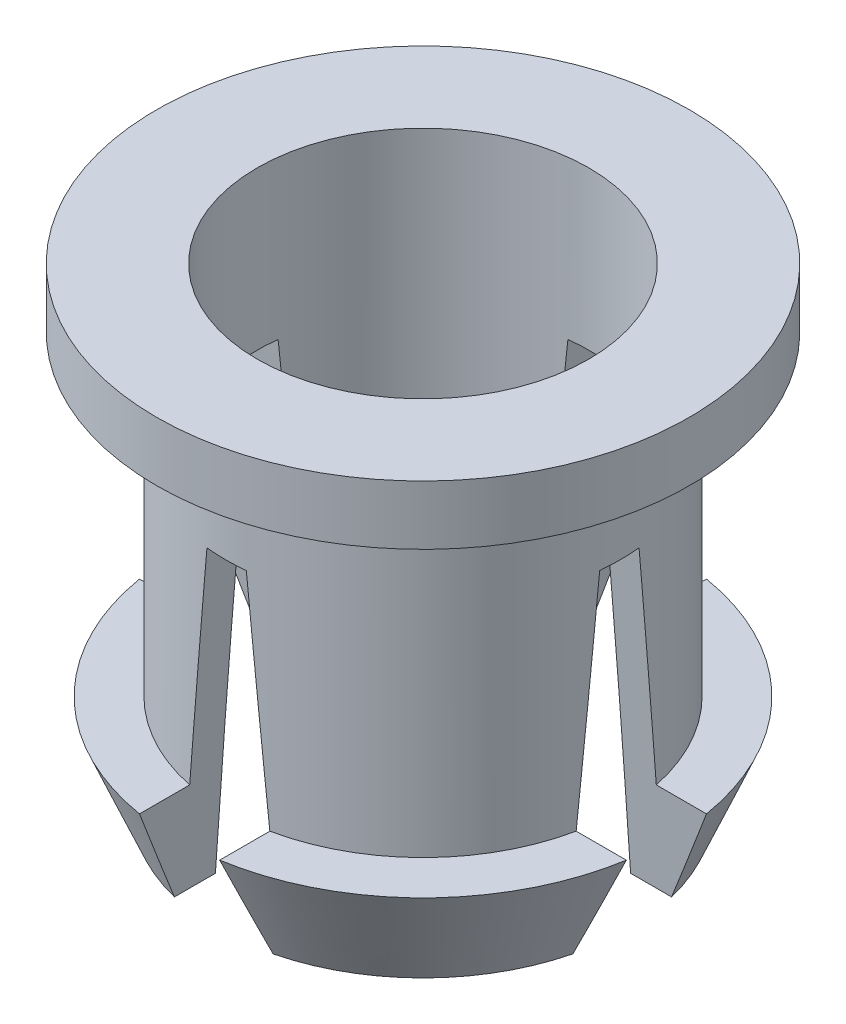
ISO-10303-21;
HEADER;
FILE_DESCRIPTION(('STEP AP214'),'2;1');
FILE_NAME('part.step','',(''),(''),'','','');
FILE_SCHEMA(('AUTOMOTIVE_DESIGN { 1 0 10303 214 1 1 1 1 }'));
ENDSEC;
DATA;
#1=APPLICATION_CONTEXT('core data for automotive mechanical design processes');
#2=APPLICATION_PROTOCOL_DEFINITION('international standard','automotive_design',2000,#1);
#3=PRODUCT_CONTEXT('',#1,'mechanical');
#4=PRODUCT('Part','Part','',(#3));
#5=PRODUCT_RELATED_PRODUCT_CATEGORY('part','',(#4));
#6=PRODUCT_DEFINITION_FORMATION('','',#4);
#7=PRODUCT_DEFINITION_CONTEXT('part definition',#1,'design');
#8=PRODUCT_DEFINITION('design','',#6,#7);
#9=PRODUCT_DEFINITION_SHAPE('','',#8);
#10=(LENGTH_UNIT() NAMED_UNIT(*) SI_UNIT(.MILLI.,.METRE.));
#11=(NAMED_UNIT(*) PLANE_ANGLE_UNIT() SI_UNIT($,.RADIAN.));
#12=(NAMED_UNIT(*) SI_UNIT($,.STERADIAN.) SOLID_ANGLE_UNIT());
#13=UNCERTAINTY_MEASURE_WITH_UNIT(LENGTH_MEASURE(1.E-05),#10,'distance_accuracy_value','');
#14=(GEOMETRIC_REPRESENTATION_CONTEXT(3) GLOBAL_UNCERTAINTY_ASSIGNED_CONTEXT((#13)) GLOBAL_UNIT_ASSIGNED_CONTEXT((#10,
#11,#12)) REPRESENTATION_CONTEXT('',''));
#15=CARTESIAN_POINT('',(0.,0.,0.));
#16=DIRECTION('',(0.,0.,1.));
#17=DIRECTION('',(1.,0.,0.));
#18=AXIS2_PLACEMENT_3D('',#15,#16,#17);
#19=CARTESIAN_POINT('',(2.1,-3.,0.));
#20=DIRECTION('',(0.,1.,0.));
#21=DIRECTION('',(0.,0.,1.));
#22=AXIS2_PLACEMENT_3D('',#19,#20,#21);
#23=PLANE('',#22);
#24=CARTESIAN_POINT('',(0.,-3.,0.));
#25=DIRECTION('',(0.,1.,0.));
#26=DIRECTION('',(0.,0.,1.));
#27=AXIS2_PLACEMENT_3D('',#24,#25,#26);
#28=CIRCLE('',#27,2.6);
#29=CARTESIAN_POINT('',(-2.52376207277944,-3.,0.625000000000009));
#30=VERTEX_POINT('',#29);
#31=CARTESIAN_POINT('',(-0.625,-3.,2.52376207277944));
#32=VERTEX_POINT('',#31);
#33=EDGE_CURVE('E218',#30,#32,#28,.T.);
#34=ORIENTED_EDGE('',*,*,#33,.F.);
#35=DIRECTION('',(1.,0.,0.));
#36=VECTOR('',#35,1.);
#37=CARTESIAN_POINT('',(-3.37500000000001,-3.,0.625000000000012));
#38=LINE('',#37,#36);
#39=CARTESIAN_POINT('',(-2.00483789868408,-3.,0.625000000000007));
#40=VERTEX_POINT('',#39);
#41=EDGE_CURVE('E494',#30,#40,#38,.T.);
#42=ORIENTED_EDGE('',*,*,#41,.T.);
#43=CARTESIAN_POINT('',(0.,-3.,0.));
#44=DIRECTION('',(0.,1.,0.));
#45=DIRECTION('',(0.,0.,1.));
#46=AXIS2_PLACEMENT_3D('',#43,#44,#45);
#47=CIRCLE('',#46,2.1);
#48=CARTESIAN_POINT('',(-0.625,-3.,2.00483789868408));
#49=VERTEX_POINT('',#48);
#50=EDGE_CURVE('E225',#40,#49,#47,.T.);
#51=ORIENTED_EDGE('',*,*,#50,.T.);
#52=DIRECTION('',(0.,0.,1.));
#53=VECTOR('',#52,1.);
#54=CARTESIAN_POINT('',(-0.625,-3.,-3.375));
#55=LINE('',#54,#53);
#56=EDGE_CURVE('E430',#49,#32,#55,.T.);
#57=ORIENTED_EDGE('',*,*,#56,.T.);
#58=EDGE_LOOP('',(#34,#42,#51,#57));
#59=FACE_BOUND('',#58,.T.);
#60=ADVANCED_FACE('F32',(#59),#23,.F.);
#61=CARTESIAN_POINT('',(0.,-3.,0.));
#62=DIRECTION('',(0.,1.,0.));
#63=DIRECTION('',(0.,0.,1.));
#64=AXIS2_PLACEMENT_3D('',#61,#62,#63);
#65=CONICAL_SURFACE('',#64,2.6,0.397627991522129);
#66=CARTESIAN_POINT('',(0.,-1.75,0.));
#67=DIRECTION('',(0.,1.,0.));
#68=DIRECTION('',(0.,0.,1.));
#69=AXIS2_PLACEMENT_3D('',#66,#67,#68);
#70=CIRCLE('',#69,3.125);
#71=CARTESIAN_POINT('',(-3.08348916969804,-1.75,0.507660851706013));
#72=VERTEX_POINT('',#71);
#73=CARTESIAN_POINT('',(-0.507660851706003,-1.75,3.08348916969804));
#74=VERTEX_POINT('',#73);
#75=EDGE_CURVE('E288',#72,#74,#70,.T.);
#76=ORIENTED_EDGE('',*,*,#75,.F.);
#77=CARTESIAN_POINT('',(-3.08357739132101,-1.7498,0.507642077442286));
#78=CARTESIAN_POINT('',(-3.03749931028814,-1.85425701063425,0.517447594771214));
#79=CARTESIAN_POINT('',(-2.99130333072685,-1.95866258349719,0.527248283568721));
#80=CARTESIAN_POINT('',(-2.89863670143563,-2.16735164706901,0.546838201150952));
#81=CARTESIAN_POINT('',(-2.85216605426808,-2.27163513890595,0.556627430041569));
#82=CARTESIAN_POINT('',(-2.75891024874476,-2.48006302847258,0.576192830875539));
#83=CARTESIAN_POINT('',(-2.71212508964057,-2.58420742587056,0.585969002787755));
#84=CARTESIAN_POINT('',(-2.61818697251316,-2.79233279292045,0.605506005434163));
#85=CARTESIAN_POINT('',(-2.57103401106228,-2.89631376103844,0.615266836024363));
#86=CARTESIAN_POINT('',(-2.52367088560967,-3.00019999999999,0.625018774263736));
#87=B_SPLINE_CURVE_WITH_KNOTS('',3,(#77,#78,#79,#80,#81,#82,#83,#84,#85,#86),.UNSPECIFIED.,.F.,
.F.,(4,2,2,2,4),(0.,0.343766631513928,0.687530061063177,1.03129430893586,1.37506176429571),.UNSPECIFIED.);
#88=EDGE_CURVE('E466',#72,#30,#87,.T.);
#89=ORIENTED_EDGE('',*,*,#88,.T.);
#90=ORIENTED_EDGE('',*,*,#33,.T.);
#91=CARTESIAN_POINT('',(-0.625018774263727,-3.0002,2.52367088560967));
#92=CARTESIAN_POINT('',(-0.615266836024355,-2.89631376103844,2.57103401106228));
#93=CARTESIAN_POINT('',(-0.605506005434154,-2.79233279292045,2.61818697251316));
#94=CARTESIAN_POINT('',(-0.585969002787746,-2.58420742587056,2.71212508964057));
#95=CARTESIAN_POINT('',(-0.57619283087553,-2.48006302847258,2.75891024874477));
#96=CARTESIAN_POINT('',(-0.556627430041559,-2.27163513890596,2.85216605426808));
#97=CARTESIAN_POINT('',(-0.546838201150942,-2.16735164706901,2.89863670143563));
#98=CARTESIAN_POINT('',(-0.527248283568711,-1.95866258349719,2.99130333072685));
#99=CARTESIAN_POINT('',(-0.517447594771203,-1.85425701063425,3.03749931028814));
#100=CARTESIAN_POINT('',(-0.507642077442275,-1.7498,3.08357739132101));
#101=B_SPLINE_CURVE_WITH_KNOTS('',3,(#91,#92,#93,#94,#95,#96,#97,#98,#99,#100),.UNSPECIFIED.,
.F.,.F.,(4,2,2,2,4),(0.,0.34376745535985,0.687531703232539,1.03129513278179,1.37506176429572),.UNSPECIFIED.);
#102=EDGE_CURVE('E317',#32,#74,#101,.T.);
#103=ORIENTED_EDGE('',*,*,#102,.T.);
#104=EDGE_LOOP('',(#76,#89,#90,#103));
#105=FACE_BOUND('',#104,.T.);
#106=ADVANCED_FACE('F356',(#105),#65,.T.);
#107=CARTESIAN_POINT('',(3.125,-1.75,0.));
#108=DIRECTION('',(0.,-1.,0.));
#109=DIRECTION('',(0.,0.,-1.));
#110=AXIS2_PLACEMENT_3D('',#107,#108,#109);
#111=PLANE('',#110);
#112=CARTESIAN_POINT('',(0.,-1.75,0.));
#113=DIRECTION('',(0.,1.,0.));
#114=DIRECTION('',(0.,0.,1.));
#115=AXIS2_PLACEMENT_3D('',#112,#113,#114);
#116=CIRCLE('',#115,2.5);
#117=CARTESIAN_POINT('',(-2.44791349104602,-1.75,0.507660851706011));
#118=VERTEX_POINT('',#117);
#119=CARTESIAN_POINT('',(-0.507660851706002,-1.75,2.44791349104602));
#120=VERTEX_POINT('',#119);
#121=EDGE_CURVE('E287',#118,#120,#116,.T.);
#122=ORIENTED_EDGE('',*,*,#121,.F.);
#123=DIRECTION('',(-1.,0.,0.));
#124=VECTOR('',#123,1.);
#125=CARTESIAN_POINT('',(3.125,-1.75,0.507660851705992));
#126=LINE('',#125,#124);
#127=EDGE_CURVE('E475',#118,#72,#126,.T.);
#128=ORIENTED_EDGE('',*,*,#127,.T.);
#129=ORIENTED_EDGE('',*,*,#75,.T.);
#130=DIRECTION('',(0.,0.,-1.));
#131=VECTOR('',#130,1.);
#132=CARTESIAN_POINT('',(-0.507660851706003,-1.75,0.));
#133=LINE('',#132,#131);
#134=EDGE_CURVE('E400',#74,#120,#133,.T.);
#135=ORIENTED_EDGE('',*,*,#134,.T.);
#136=EDGE_LOOP('',(#122,#128,#129,#135));
#137=FACE_BOUND('',#136,.T.);
#138=ADVANCED_FACE('F349',(#137),#111,.F.);
#139=CARTESIAN_POINT('',(0.625,-3.,2.00483789868408));
#140=VERTEX_POINT('',#139);
#141=CARTESIAN_POINT('',(2.00483789868408,-3.,0.624999999999993));
#142=VERTEX_POINT('',#141);
#143=EDGE_CURVE('E231',#140,#142,#47,.T.);
#144=ORIENTED_EDGE('',*,*,#143,.T.);
#145=CARTESIAN_POINT('',(2.52376207277945,-3.,0.624999999999991));
#146=VERTEX_POINT('',#145);
#147=EDGE_CURVE('E495',#142,#146,#38,.T.);
#148=ORIENTED_EDGE('',*,*,#147,.T.);
#149=CARTESIAN_POINT('',(0.625,-3.,2.52376207277945));
#150=VERTEX_POINT('',#149);
#151=EDGE_CURVE('E220',#150,#146,#28,.T.);
#152=ORIENTED_EDGE('',*,*,#151,.F.);
#153=DIRECTION('',(0.,0.,1.));
#154=VECTOR('',#153,1.);
#155=CARTESIAN_POINT('',(0.625,-3.,-3.375));
#156=LINE('',#155,#154);
#157=EDGE_CURVE('E434',#140,#150,#156,.T.);
#158=ORIENTED_EDGE('',*,*,#157,.F.);
#159=EDGE_LOOP('',(#144,#148,#152,#158));
#160=FACE_BOUND('',#159,.T.);
#161=ADVANCED_FACE('F358',(#160),#23,.F.);
#162=ORIENTED_EDGE('',*,*,#151,.T.);
#163=CARTESIAN_POINT('',(2.52367088560967,-3.00019999999999,0.625018774263718));
#164=CARTESIAN_POINT('',(2.57103401106228,-2.89631376103844,0.615266836024345));
#165=CARTESIAN_POINT('',(2.61818697251317,-2.79233279292045,0.605506005434145));
#166=CARTESIAN_POINT('',(2.71212508964057,-2.58420742587056,0.585969002787736));
#167=CARTESIAN_POINT('',(2.75891024874477,-2.48006302847258,0.57619283087552));
#168=CARTESIAN_POINT('',(2.85216605426809,-2.27163513890595,0.556627430041549));
#169=CARTESIAN_POINT('',(2.89863670143564,-2.16735164706901,0.546838201150932));
#170=CARTESIAN_POINT('',(2.99130333072686,-1.95866258349718,0.5272482835687));
#171=CARTESIAN_POINT('',(3.03749931028814,-1.85425701063425,0.517447594771193));
#172=CARTESIAN_POINT('',(3.08357739132101,-1.7498,0.507642077442265));
#173=B_SPLINE_CURVE_WITH_KNOTS('',3,(#163,#164,#165,#166,#167,#168,#169,#170,#171,#172),
.UNSPECIFIED.,.F.,.F.,(4,2,2,2,4),(0.,0.343767455359848,0.687531703232537,1.03129513278179,
1.37506176429571),.UNSPECIFIED.);
#174=CARTESIAN_POINT('',(3.08348916969805,-1.75,0.507660851705992));
#175=VERTEX_POINT('',#174);
#176=EDGE_CURVE('E446',#146,#175,#173,.T.);
#177=ORIENTED_EDGE('',*,*,#176,.T.);
#178=CARTESIAN_POINT('',(0.507660851706003,-1.75,3.08348916969804));
#179=VERTEX_POINT('',#178);
#180=EDGE_CURVE('E221',#179,#175,#70,.T.);
#181=ORIENTED_EDGE('',*,*,#180,.F.);
#182=CARTESIAN_POINT('',(0.507642077442275,-1.7498,3.08357739132101));
#183=CARTESIAN_POINT('',(0.517447594771203,-1.85425701063425,3.03749931028814));
#184=CARTESIAN_POINT('',(0.527248283568711,-1.95866258349719,2.99130333072685));
#185=CARTESIAN_POINT('',(0.546838201150942,-2.16735164706901,2.89863670143563));
#186=CARTESIAN_POINT('',(0.556627430041559,-2.27163513890596,2.85216605426809));
#187=CARTESIAN_POINT('',(0.57619283087553,-2.48006302847258,2.75891024874477));
#188=CARTESIAN_POINT('',(0.585969002787746,-2.58420742587056,2.71212508964057));
#189=CARTESIAN_POINT('',(0.605506005434155,-2.79233279292046,2.61818697251316));
#190=CARTESIAN_POINT('',(0.615266836024355,-2.89631376103844,2.57103401106228));
#191=CARTESIAN_POINT('',(0.625018774263727,-3.0002,2.52367088560967));
#192=B_SPLINE_CURVE_WITH_KNOTS('',3,(#182,#183,#184,#185,#186,#187,#188,#189,#190,#191),
.UNSPECIFIED.,.F.,.F.,(4,2,2,2,4),(0.,0.343766631513929,0.687530061063181,1.03129430893587,
1.37506176429572),.UNSPECIFIED.);
#193=EDGE_CURVE('E415',#179,#150,#192,.T.);
#194=ORIENTED_EDGE('',*,*,#193,.T.);
#195=EDGE_LOOP('',(#162,#177,#181,#194));
#196=FACE_BOUND('',#195,.T.);
#197=ADVANCED_FACE('F368',(#196),#65,.T.);
#198=ORIENTED_EDGE('',*,*,#180,.T.);
#199=DIRECTION('',(-1.,0.,0.));
#200=VECTOR('',#199,1.);
#201=CARTESIAN_POINT('',(3.125,-1.75,0.507660851705992));
#202=LINE('',#201,#200);
#203=CARTESIAN_POINT('',(2.44791349104603,-1.75,0.507660851705994));
#204=VERTEX_POINT('',#203);
#205=EDGE_CURVE('E393',#175,#204,#202,.T.);
#206=ORIENTED_EDGE('',*,*,#205,.T.);
#207=CARTESIAN_POINT('',(0.507660851706003,-1.75,2.44791349104602));
#208=VERTEX_POINT('',#207);
#209=EDGE_CURVE('E284',#208,#204,#116,.T.);
#210=ORIENTED_EDGE('',*,*,#209,.F.);
#211=DIRECTION('',(0.,0.,1.));
#212=VECTOR('',#211,1.);
#213=CARTESIAN_POINT('',(0.507660851706003,-1.75,0.));
#214=LINE('',#213,#212);
#215=EDGE_CURVE('E394',#208,#179,#214,.T.);
#216=ORIENTED_EDGE('',*,*,#215,.T.);
#217=EDGE_LOOP('',(#198,#206,#210,#216));
#218=FACE_BOUND('',#217,.T.);
#219=ADVANCED_FACE('F360',(#218),#111,.F.);
#220=CARTESIAN_POINT('',(-0.625,-3.,-2.00483789868408));
#221=VERTEX_POINT('',#220);
#222=CARTESIAN_POINT('',(-2.00483789868408,-3.,-0.624999999999993));
#223=VERTEX_POINT('',#222);
#224=EDGE_CURVE('E211',#221,#223,#47,.T.);
#225=ORIENTED_EDGE('',*,*,#224,.T.);
#226=DIRECTION('',(1.,0.,0.));
#227=VECTOR('',#226,1.);
#228=CARTESIAN_POINT('',(-3.37500000000001,-3.,-0.624999999999988));
#229=LINE('',#228,#227);
#230=CARTESIAN_POINT('',(-2.52376207277945,-3.,-0.624999999999991));
#231=VERTEX_POINT('',#230);
#232=EDGE_CURVE('E194',#231,#223,#229,.T.);
#233=ORIENTED_EDGE('',*,*,#232,.F.);
#234=CARTESIAN_POINT('',(-0.625,-3.,-2.52376207277944));
#235=VERTEX_POINT('',#234);
#236=EDGE_CURVE('E209',#235,#231,#28,.T.);
#237=ORIENTED_EDGE('',*,*,#236,.F.);
#238=EDGE_CURVE('E432',#235,#221,#55,.T.);
#239=ORIENTED_EDGE('',*,*,#238,.T.);
#240=EDGE_LOOP('',(#225,#233,#237,#239));
#241=FACE_BOUND('',#240,.T.);
#242=ADVANCED_FACE('F207',(#241),#23,.F.);
#243=ORIENTED_EDGE('',*,*,#236,.T.);
#244=CARTESIAN_POINT('',(-2.52367088560967,-3.00019999999999,-0.625018774263718));
#245=CARTESIAN_POINT('',(-2.57103401106228,-2.89631376103844,-0.615266836024345));
#246=CARTESIAN_POINT('',(-2.61818697251316,-2.79233279292045,-0.605506005434145));
#247=CARTESIAN_POINT('',(-2.71212508964057,-2.58420742587056,-0.585969002787736));
#248=CARTESIAN_POINT('',(-2.75891024874477,-2.48006302847258,-0.57619283087552));
#249=CARTESIAN_POINT('',(-2.85216605426809,-2.27163513890595,-0.556627430041549));
#250=CARTESIAN_POINT('',(-2.89863670143563,-2.16735164706901,-0.546838201150932));
#251=CARTESIAN_POINT('',(-2.99130333072686,-1.95866258349718,-0.5272482835687));
#252=CARTESIAN_POINT('',(-3.03749931028814,-1.85425701063425,-0.517447594771193));
#253=CARTESIAN_POINT('',(-3.08357739132101,-1.7498,-0.507642077442265));
#254=B_SPLINE_CURVE_WITH_KNOTS('',3,(#244,#245,#246,#247,#248,#249,#250,#251,#252,#253),
.UNSPECIFIED.,.F.,.F.,(4,2,2,2,4),(0.,0.343767455359849,0.687531703232536,1.03129513278179,
1.37506176429571),.UNSPECIFIED.);
#255=CARTESIAN_POINT('',(-3.08348916969805,-1.75,-0.507660851705992));
#256=VERTEX_POINT('',#255);
#257=EDGE_CURVE('E191',#231,#256,#254,.T.);
#258=ORIENTED_EDGE('',*,*,#257,.T.);
#259=CARTESIAN_POINT('',(-0.507660851706003,-1.75,-3.08348916969804));
#260=VERTEX_POINT('',#259);
#261=EDGE_CURVE('E396',#260,#256,#70,.T.);
#262=ORIENTED_EDGE('',*,*,#261,.F.);
#263=CARTESIAN_POINT('',(-0.507642077442275,-1.7498,-3.08357739132101));
#264=CARTESIAN_POINT('',(-0.517447594771203,-1.85425701063425,-3.03749931028814));
#265=CARTESIAN_POINT('',(-0.52724828356871,-1.95866258349719,-2.99130333072685));
#266=CARTESIAN_POINT('',(-0.546838201150942,-2.16735164706901,-2.89863670143563));
#267=CARTESIAN_POINT('',(-0.556627430041559,-2.27163513890595,-2.85216605426808));
#268=CARTESIAN_POINT('',(-0.57619283087553,-2.48006302847258,-2.75891024874477));
#269=CARTESIAN_POINT('',(-0.585969002787746,-2.58420742587056,-2.71212508964057));
#270=CARTESIAN_POINT('',(-0.605506005434154,-2.79233279292045,-2.61818697251316));
#271=CARTESIAN_POINT('',(-0.615266836024355,-2.89631376103844,-2.57103401106228));
#272=CARTESIAN_POINT('',(-0.625018774263727,-3.0002,-2.52367088560967));
#273=B_SPLINE_CURVE_WITH_KNOTS('',3,(#263,#264,#265,#266,#267,#268,#269,#270,#271,#272),
.UNSPECIFIED.,.F.,.F.,(4,2,2,2,4),(0.,0.343766631513929,0.68753006106318,1.03129430893587,
1.37506176429572),.UNSPECIFIED.);
#274=EDGE_CURVE('E216',#260,#235,#273,.T.);
#275=ORIENTED_EDGE('',*,*,#274,.T.);
#276=EDGE_LOOP('',(#243,#258,#262,#275));
#277=FACE_BOUND('',#276,.T.);
#278=ADVANCED_FACE('F215',(#277),#65,.T.);
#279=ORIENTED_EDGE('',*,*,#261,.T.);
#280=DIRECTION('',(1.,0.,0.));
#281=VECTOR('',#280,1.);
#282=CARTESIAN_POINT('',(3.125,-1.75,-0.507660851706013));
#283=LINE('',#282,#281);
#284=CARTESIAN_POINT('',(-2.44791349104603,-1.75,-0.507660851705994));
#285=VERTEX_POINT('',#284);
#286=EDGE_CURVE('E197',#256,#285,#283,.T.);
#287=ORIENTED_EDGE('',*,*,#286,.T.);
#288=CARTESIAN_POINT('',(-0.507660851706002,-1.75,-2.44791349104602));
#289=VERTEX_POINT('',#288);
#290=EDGE_CURVE('E285',#289,#285,#116,.T.);
#291=ORIENTED_EDGE('',*,*,#290,.F.);
#292=EDGE_CURVE('E316',#289,#260,#133,.T.);
#293=ORIENTED_EDGE('',*,*,#292,.T.);
#294=EDGE_LOOP('',(#279,#287,#291,#293));
#295=FACE_BOUND('',#294,.T.);
#296=ADVANCED_FACE('F350',(#295),#111,.F.);
#297=CARTESIAN_POINT('',(3.375,3.,0.));
#298=DIRECTION('',(0.,-1.,0.));
#299=DIRECTION('',(0.,0.,-1.));
#300=AXIS2_PLACEMENT_3D('',#297,#298,#299);
#301=PLANE('',#300);
#302=CARTESIAN_POINT('',(0.,3.,0.));
#303=DIRECTION('',(0.,1.,0.));
#304=DIRECTION('',(0.,0.,1.));
#305=AXIS2_PLACEMENT_3D('',#302,#303,#304);
#306=CIRCLE('',#305,2.1);
#307=CARTESIAN_POINT('',(0.,3.,2.1));
#308=VERTEX_POINT('',#307);
#309=EDGE_CURVE('E239',#308,#308,#306,.T.);
#310=ORIENTED_EDGE('',*,*,#309,.F.);
#311=EDGE_LOOP('',(#310));
#312=FACE_BOUND('',#311,.T.);
#313=CARTESIAN_POINT('',(0.,3.,0.));
#314=DIRECTION('',(0.,1.,0.));
#315=DIRECTION('',(0.,0.,1.));
#316=AXIS2_PLACEMENT_3D('',#313,#314,#315);
#317=CIRCLE('',#316,3.375);
#318=CARTESIAN_POINT('',(0.,3.,3.375));
#319=VERTEX_POINT('',#318);
#320=EDGE_CURVE('E300',#319,#319,#317,.T.);
#321=ORIENTED_EDGE('',*,*,#320,.T.);
#322=EDGE_LOOP('',(#321));
#323=FACE_BOUND('',#322,.T.);
#324=ADVANCED_FACE('F34',(#312,#323),#301,.F.);
#325=CARTESIAN_POINT('',(0.,3.,0.));
#326=DIRECTION('',(0.,1.,0.));
#327=DIRECTION('',(0.,0.,1.));
#328=AXIS2_PLACEMENT_3D('',#325,#326,#327);
#329=CYLINDRICAL_SURFACE('',#328,2.1);
#330=CARTESIAN_POINT('',(0.,1.,0.));
#331=DIRECTION('',(0.,1.,0.));
#332=DIRECTION('',(0.,0.,1.));
#333=AXIS2_PLACEMENT_3D('',#330,#331,#332);
#334=CIRCLE('',#333,2.1);
#335=CARTESIAN_POINT('',(2.08512407347357,1.,-0.249514725459215));
#336=VERTEX_POINT('',#335);
#337=CARTESIAN_POINT('',(2.08512407347357,1.,0.2495147254592));
#338=VERTEX_POINT('',#337);
#339=EDGE_CURVE('E490',#336,#338,#334,.F.);
#340=ORIENTED_EDGE('',*,*,#339,.T.);
#341=CARTESIAN_POINT('',(0.,3.65805071332671,0.));
#342=DIRECTION('',(0.,0.0934604432801498,0.995622993678771));
#343=DIRECTION('',(0.,0.995622993678771,-0.0934604432801498));
#344=AXIS2_PLACEMENT_3D('',#341,#342,#343);
#345=ELLIPSE('',#344,22.4693990986668,2.1);
#346=EDGE_CURVE('E433',#338,#142,#345,.F.);
#347=ORIENTED_EDGE('',*,*,#346,.T.);
#348=ORIENTED_EDGE('',*,*,#143,.F.);
#349=CARTESIAN_POINT('',(0.,3.65805071332671,0.));
#350=DIRECTION('',(0.995622993678771,0.0934604432801498,0.));
#351=DIRECTION('',(-0.0934604432801498,0.995622993678771,0.));
#352=AXIS2_PLACEMENT_3D('',#349,#350,#351);
#353=ELLIPSE('',#352,22.4693990986668,2.1);
#354=CARTESIAN_POINT('',(0.249514725459208,1.,2.08512407347357));
#355=VERTEX_POINT('',#354);
#356=EDGE_CURVE('E412',#140,#355,#353,.F.);
#357=ORIENTED_EDGE('',*,*,#356,.T.);
#358=CARTESIAN_POINT('',(0.,1.,0.));
#359=DIRECTION('',(0.,1.,0.));
#360=DIRECTION('',(0.,0.,1.));
#361=AXIS2_PLACEMENT_3D('',#358,#359,#360);
#362=CIRCLE('',#361,2.1);
#363=CARTESIAN_POINT('',(-0.249514725459208,1.,2.08512407347357));
#364=VERTEX_POINT('',#363);
#365=EDGE_CURVE('E407',#355,#364,#362,.F.);
#366=ORIENTED_EDGE('',*,*,#365,.T.);
#367=CARTESIAN_POINT('',(0.,3.65805071332672,0.));
#368=DIRECTION('',(-0.995622993678771,0.0934604432801498,0.));
#369=DIRECTION('',(0.0934604432801498,0.995622993678771,0.));
#370=AXIS2_PLACEMENT_3D('',#367,#368,#369);
#371=ELLIPSE('',#370,22.4693990986668,2.1);
#372=EDGE_CURVE('E305',#364,#49,#371,.F.);
#373=ORIENTED_EDGE('',*,*,#372,.T.);
#374=ORIENTED_EDGE('',*,*,#50,.F.);
#375=CARTESIAN_POINT('',(0.,3.65805071332671,0.));
#376=DIRECTION('',(0.,0.0934604432801498,0.995622993678771));
#377=DIRECTION('',(0.,0.995622993678771,-0.0934604432801498));
#378=AXIS2_PLACEMENT_3D('',#375,#376,#377);
#379=ELLIPSE('',#378,22.4693990986668,2.1);
#380=CARTESIAN_POINT('',(-2.08512407347357,1.,0.249514725459215));
#381=VERTEX_POINT('',#380);
#382=EDGE_CURVE('E474',#40,#381,#379,.F.);
#383=ORIENTED_EDGE('',*,*,#382,.T.);
#384=CARTESIAN_POINT('',(-2.08512407347357,1.,-0.2495147254592));
#385=VERTEX_POINT('',#384);
#386=EDGE_CURVE('E502',#381,#385,#334,.F.);
#387=ORIENTED_EDGE('',*,*,#386,.T.);
#388=CARTESIAN_POINT('',(0.,3.65805071332671,0.));
#389=DIRECTION('',(0.,0.0934604432801498,-0.995622993678771));
#390=DIRECTION('',(0.,0.995622993678771,0.0934604432801498));
#391=AXIS2_PLACEMENT_3D('',#388,#389,#390);
#392=ELLIPSE('',#391,22.4693990986668,2.1);
#393=EDGE_CURVE('E202',#385,#223,#392,.F.);
#394=ORIENTED_EDGE('',*,*,#393,.T.);
#395=ORIENTED_EDGE('',*,*,#224,.F.);
#396=CARTESIAN_POINT('',(-0.249514725459208,1.,-2.08512407347357));
#397=VERTEX_POINT('',#396);
#398=EDGE_CURVE('E306',#221,#397,#371,.F.);
#399=ORIENTED_EDGE('',*,*,#398,.T.);
#400=CARTESIAN_POINT('',(0.249514725459208,1.,-2.08512407347357));
#401=VERTEX_POINT('',#400);
#402=EDGE_CURVE('E404',#397,#401,#362,.F.);
#403=ORIENTED_EDGE('',*,*,#402,.T.);
#404=CARTESIAN_POINT('',(0.625,-3.,-2.00483789868408));
#405=VERTEX_POINT('',#404);
#406=EDGE_CURVE('E410',#401,#405,#353,.F.);
#407=ORIENTED_EDGE('',*,*,#406,.T.);
#408=CARTESIAN_POINT('',(2.00483789868408,-3.,-0.625000000000007));
#409=VERTEX_POINT('',#408);
#410=EDGE_CURVE('E230',#409,#405,#47,.T.);
#411=ORIENTED_EDGE('',*,*,#410,.F.);
#412=CARTESIAN_POINT('',(0.,3.65805071332671,0.));
#413=DIRECTION('',(0.,0.0934604432801498,-0.995622993678771));
#414=DIRECTION('',(0.,0.995622993678771,0.0934604432801498));
#415=AXIS2_PLACEMENT_3D('',#412,#413,#414);
#416=ELLIPSE('',#415,22.4693990986668,2.1);
#417=EDGE_CURVE('E486',#409,#336,#416,.F.);
#418=ORIENTED_EDGE('',*,*,#417,.T.);
#419=EDGE_LOOP('',(#340,#347,#348,#357,#366,#373,#374,#383,#387,#394,#395,#399,#403,#407,#411,#418));
#420=FACE_BOUND('',#419,.T.);
#421=ORIENTED_EDGE('',*,*,#309,.T.);
#422=EDGE_LOOP('',(#421));
#423=FACE_BOUND('',#422,.T.);
#424=ADVANCED_FACE('F372',(#420,#423),#329,.F.);
#425=CARTESIAN_POINT('',(2.52376207277944,-3.,-0.625000000000009));
#426=VERTEX_POINT('',#425);
#427=CARTESIAN_POINT('',(0.625,-3.,-2.52376207277945));
#428=VERTEX_POINT('',#427);
#429=EDGE_CURVE('E217',#426,#428,#28,.T.);
#430=ORIENTED_EDGE('',*,*,#429,.F.);
#431=EDGE_CURVE('E212',#409,#426,#229,.T.);
#432=ORIENTED_EDGE('',*,*,#431,.F.);
#433=ORIENTED_EDGE('',*,*,#410,.T.);
#434=EDGE_CURVE('E436',#428,#405,#156,.T.);
#435=ORIENTED_EDGE('',*,*,#434,.F.);
#436=EDGE_LOOP('',(#430,#432,#433,#435));
#437=FACE_BOUND('',#436,.T.);
#438=ADVANCED_FACE('F354',(#437),#23,.F.);
#439=CARTESIAN_POINT('',(3.08348916969804,-1.75,-0.507660851706013));
#440=VERTEX_POINT('',#439);
#441=CARTESIAN_POINT('',(0.507660851706003,-1.75,-3.08348916969804));
#442=VERTEX_POINT('',#441);
#443=EDGE_CURVE('E395',#440,#442,#70,.T.);
#444=ORIENTED_EDGE('',*,*,#443,.F.);
#445=CARTESIAN_POINT('',(3.08357739132101,-1.7498,-0.507642077442286));
#446=CARTESIAN_POINT('',(3.03749931028814,-1.85425701063425,-0.517447594771214));
#447=CARTESIAN_POINT('',(2.99130333072685,-1.95866258349719,-0.527248283568721));
#448=CARTESIAN_POINT('',(2.89863670143563,-2.16735164706901,-0.546838201150952));
#449=CARTESIAN_POINT('',(2.85216605426808,-2.27163513890595,-0.556627430041569));
#450=CARTESIAN_POINT('',(2.75891024874477,-2.48006302847258,-0.576192830875539));
#451=CARTESIAN_POINT('',(2.71212508964057,-2.58420742587056,-0.585969002787755));
#452=CARTESIAN_POINT('',(2.61818697251316,-2.79233279292045,-0.605506005434163));
#453=CARTESIAN_POINT('',(2.57103401106228,-2.89631376103844,-0.615266836024363));
#454=CARTESIAN_POINT('',(2.52367088560967,-3.0002,-0.625018774263736));
#455=B_SPLINE_CURVE_WITH_KNOTS('',3,(#445,#446,#447,#448,#449,#450,#451,#452,#453,#454),
.UNSPECIFIED.,.F.,.F.,(4,2,2,2,4),(0.,0.343766631513928,0.687530061063177,1.03129430893587,
1.37506176429571),.UNSPECIFIED.);
#456=EDGE_CURVE('E480',#440,#426,#455,.T.);
#457=ORIENTED_EDGE('',*,*,#456,.T.);
#458=ORIENTED_EDGE('',*,*,#429,.T.);
#459=CARTESIAN_POINT('',(0.625018774263727,-3.0002,-2.52367088560967));
#460=CARTESIAN_POINT('',(0.615266836024355,-2.89631376103844,-2.57103401106228));
#461=CARTESIAN_POINT('',(0.605506005434155,-2.79233279292045,-2.61818697251316));
#462=CARTESIAN_POINT('',(0.585969002787746,-2.58420742587056,-2.71212508964057));
#463=CARTESIAN_POINT('',(0.57619283087553,-2.48006302847258,-2.75891024874477));
#464=CARTESIAN_POINT('',(0.556627430041559,-2.27163513890596,-2.85216605426809));
#465=CARTESIAN_POINT('',(0.546838201150942,-2.16735164706901,-2.89863670143563));
#466=CARTESIAN_POINT('',(0.527248283568711,-1.95866258349719,-2.99130333072685));
#467=CARTESIAN_POINT('',(0.517447594771203,-1.85425701063425,-3.03749931028814));
#468=CARTESIAN_POINT('',(0.507642077442276,-1.7498,-3.08357739132101));
#469=B_SPLINE_CURVE_WITH_KNOTS('',3,(#459,#460,#461,#462,#463,#464,#465,#466,#467,#468),
.UNSPECIFIED.,.F.,.F.,(4,2,2,2,4),(0.,0.343767455359851,0.68753170323254,1.03129513278179,
1.37506176429572),.UNSPECIFIED.);
#470=EDGE_CURVE('E421',#428,#442,#469,.T.);
#471=ORIENTED_EDGE('',*,*,#470,.T.);
#472=EDGE_LOOP('',(#444,#457,#458,#471));
#473=FACE_BOUND('',#472,.T.);
#474=ADVANCED_FACE('F323',(#473),#65,.T.);
#475=CARTESIAN_POINT('',(2.44791349104602,-1.75,-0.507660851706011));
#476=VERTEX_POINT('',#475);
#477=CARTESIAN_POINT('',(0.507660851706003,-1.75,-2.44791349104602));
#478=VERTEX_POINT('',#477);
#479=EDGE_CURVE('E272',#476,#478,#116,.T.);
#480=ORIENTED_EDGE('',*,*,#479,.F.);
#481=DIRECTION('',(1.,0.,0.));
#482=VECTOR('',#481,1.);
#483=CARTESIAN_POINT('',(3.125,-1.75,-0.507660851706013));
#484=LINE('',#483,#482);
#485=EDGE_CURVE('E280',#476,#440,#484,.T.);
#486=ORIENTED_EDGE('',*,*,#485,.T.);
#487=ORIENTED_EDGE('',*,*,#443,.T.);
#488=EDGE_CURVE('E283',#442,#478,#214,.T.);
#489=ORIENTED_EDGE('',*,*,#488,.T.);
#490=EDGE_LOOP('',(#480,#486,#487,#489));
#491=FACE_BOUND('',#490,.T.);
#492=ADVANCED_FACE('F279',(#491),#111,.F.);
#493=CARTESIAN_POINT('',(0.,3.,0.));
#494=DIRECTION('',(0.,1.,0.));
#495=DIRECTION('',(0.,0.,1.));
#496=AXIS2_PLACEMENT_3D('',#493,#494,#495);
#497=CYLINDRICAL_SURFACE('',#496,2.5);
#498=ORIENTED_EDGE('',*,*,#209,.T.);
#499=CARTESIAN_POINT('',(0.,3.65805071332671,0.));
#500=DIRECTION('',(0.,0.0934604432801498,0.995622993678771));
#501=DIRECTION('',(0.,0.995622993678771,-0.0934604432801498));
#502=AXIS2_PLACEMENT_3D('',#499,#500,#501);
#503=ELLIPSE('',#502,26.74928464127,2.5);
#504=CARTESIAN_POINT('',(2.48751731688023,1.,0.249514725459199));
#505=VERTEX_POINT('',#504);
#506=EDGE_CURVE('E11',#204,#505,#503,.T.);
#507=ORIENTED_EDGE('',*,*,#506,.T.);
#508=CARTESIAN_POINT('',(0.,1.,0.));
#509=DIRECTION('',(0.,1.,0.));
#510=DIRECTION('',(0.,0.,1.));
#511=AXIS2_PLACEMENT_3D('',#508,#509,#510);
#512=CIRCLE('',#511,2.5);
#513=CARTESIAN_POINT('',(2.48751731688023,1.,-0.249514725459216));
#514=VERTEX_POINT('',#513);
#515=EDGE_CURVE('E274',#505,#514,#512,.T.);
#516=ORIENTED_EDGE('',*,*,#515,.T.);
#517=CARTESIAN_POINT('',(0.,3.65805071332671,0.));
#518=DIRECTION('',(0.,0.0934604432801498,-0.995622993678771));
#519=DIRECTION('',(0.,0.995622993678771,0.0934604432801498));
#520=AXIS2_PLACEMENT_3D('',#517,#518,#519);
#521=ELLIPSE('',#520,26.74928464127,2.5);
#522=EDGE_CURVE('E40',#514,#476,#521,.T.);
#523=ORIENTED_EDGE('',*,*,#522,.T.);
#524=ORIENTED_EDGE('',*,*,#479,.T.);
#525=CARTESIAN_POINT('',(0.,3.65805071332671,0.));
#526=DIRECTION('',(0.995622993678771,0.0934604432801498,0.));
#527=DIRECTION('',(-0.0934604432801498,0.995622993678771,0.));
#528=AXIS2_PLACEMENT_3D('',#525,#526,#527);
#529=ELLIPSE('',#528,26.74928464127,2.5);
#530=CARTESIAN_POINT('',(0.249514725459208,1.,-2.48751731688023));
#531=VERTEX_POINT('',#530);
#532=EDGE_CURVE('E245',#478,#531,#529,.T.);
#533=ORIENTED_EDGE('',*,*,#532,.T.);
#534=CARTESIAN_POINT('',(0.,1.,0.));
#535=DIRECTION('',(0.,1.,0.));
#536=DIRECTION('',(0.,0.,1.));
#537=AXIS2_PLACEMENT_3D('',#534,#535,#536);
#538=CIRCLE('',#537,2.5);
#539=CARTESIAN_POINT('',(-0.249514725459208,1.,-2.48751731688023));
#540=VERTEX_POINT('',#539);
#541=EDGE_CURVE('E249',#531,#540,#538,.T.);
#542=ORIENTED_EDGE('',*,*,#541,.T.);
#543=CARTESIAN_POINT('',(0.,3.65805071332672,0.));
#544=DIRECTION('',(-0.995622993678771,0.0934604432801498,0.));
#545=DIRECTION('',(0.0934604432801498,0.995622993678771,0.));
#546=AXIS2_PLACEMENT_3D('',#543,#544,#545);
#547=ELLIPSE('',#546,26.74928464127,2.5);
#548=EDGE_CURVE('E255',#540,#289,#547,.T.);
#549=ORIENTED_EDGE('',*,*,#548,.T.);
#550=ORIENTED_EDGE('',*,*,#290,.T.);
#551=CARTESIAN_POINT('',(0.,3.65805071332671,0.));
#552=DIRECTION('',(0.,0.0934604432801498,-0.995622993678771));
#553=DIRECTION('',(0.,0.995622993678771,0.0934604432801498));
#554=AXIS2_PLACEMENT_3D('',#551,#552,#553);
#555=ELLIPSE('',#554,26.74928464127,2.5);
#556=CARTESIAN_POINT('',(-2.48751731688023,1.,-0.249514725459199));
#557=VERTEX_POINT('',#556);
#558=EDGE_CURVE('E260',#285,#557,#555,.T.);
#559=ORIENTED_EDGE('',*,*,#558,.T.);
#560=CARTESIAN_POINT('',(-2.48751731688023,1.,0.249514725459216));
#561=VERTEX_POINT('',#560);
#562=EDGE_CURVE('E501',#557,#561,#512,.T.);
#563=ORIENTED_EDGE('',*,*,#562,.T.);
#564=CARTESIAN_POINT('',(0.,3.65805071332671,0.));
#565=DIRECTION('',(0.,0.0934604432801498,0.995622993678771));
#566=DIRECTION('',(0.,0.995622993678771,-0.0934604432801498));
#567=AXIS2_PLACEMENT_3D('',#564,#565,#566);
#568=ELLIPSE('',#567,26.74928464127,2.5);
#569=EDGE_CURVE('E263',#561,#118,#568,.T.);
#570=ORIENTED_EDGE('',*,*,#569,.T.);
#571=ORIENTED_EDGE('',*,*,#121,.T.);
#572=CARTESIAN_POINT('',(-0.249514725459208,1.,2.48751731688023));
#573=VERTEX_POINT('',#572);
#574=EDGE_CURVE('E259',#120,#573,#547,.T.);
#575=ORIENTED_EDGE('',*,*,#574,.T.);
#576=CARTESIAN_POINT('',(0.249514725459208,1.,2.48751731688023));
#577=VERTEX_POINT('',#576);
#578=EDGE_CURVE('E256',#573,#577,#538,.T.);
#579=ORIENTED_EDGE('',*,*,#578,.T.);
#580=EDGE_CURVE('E251',#577,#208,#529,.T.);
#581=ORIENTED_EDGE('',*,*,#580,.T.);
#582=EDGE_LOOP('',(#498,#507,#516,#523,#524,#533,#542,#549,#550,#559,#563,#570,#571,#575,#579,#581));
#583=FACE_BOUND('',#582,.T.);
#584=CARTESIAN_POINT('',(0.,2.25,0.));
#585=DIRECTION('',(0.,1.,0.));
#586=DIRECTION('',(0.,0.,1.));
#587=AXIS2_PLACEMENT_3D('',#584,#585,#586);
#588=CIRCLE('',#587,2.5);
#589=CARTESIAN_POINT('',(0.,2.25,2.5));
#590=VERTEX_POINT('',#589);
#591=EDGE_CURVE('E291',#590,#590,#588,.T.);
#592=ORIENTED_EDGE('',*,*,#591,.F.);
#593=EDGE_LOOP('',(#592));
#594=FACE_BOUND('',#593,.T.);
#595=ADVANCED_FACE('F270',(#583,#594),#497,.T.);
#596=CARTESIAN_POINT('',(2.5,2.25,0.));
#597=DIRECTION('',(0.,1.,0.));
#598=DIRECTION('',(0.,0.,1.));
#599=AXIS2_PLACEMENT_3D('',#596,#597,#598);
#600=PLANE('',#599);
#601=CARTESIAN_POINT('',(0.,2.25,0.));
#602=DIRECTION('',(0.,1.,0.));
#603=DIRECTION('',(0.,0.,1.));
#604=AXIS2_PLACEMENT_3D('',#601,#602,#603);
#605=CIRCLE('',#604,3.375);
#606=CARTESIAN_POINT('',(0.,2.25,3.375));
#607=VERTEX_POINT('',#606);
#608=EDGE_CURVE('E296',#607,#607,#605,.T.);
#609=ORIENTED_EDGE('',*,*,#608,.F.);
#610=EDGE_LOOP('',(#609));
#611=FACE_BOUND('',#610,.T.);
#612=ORIENTED_EDGE('',*,*,#591,.T.);
#613=EDGE_LOOP('',(#612));
#614=FACE_BOUND('',#613,.T.);
#615=ADVANCED_FACE('F342',(#611,#614),#600,.F.);
#616=CARTESIAN_POINT('',(0.,3.,0.));
#617=DIRECTION('',(0.,1.,0.));
#618=DIRECTION('',(0.,0.,1.));
#619=AXIS2_PLACEMENT_3D('',#616,#617,#618);
#620=CYLINDRICAL_SURFACE('',#619,3.375);
#621=ORIENTED_EDGE('',*,*,#320,.F.);
#622=EDGE_LOOP('',(#621));
#623=FACE_BOUND('',#622,.T.);
#624=ORIENTED_EDGE('',*,*,#608,.T.);
#625=EDGE_LOOP('',(#624));
#626=FACE_BOUND('',#625,.T.);
#627=ADVANCED_FACE('F338',(#623,#626),#620,.T.);
#628=CARTESIAN_POINT('',(0.249514725459208,1.,-3.375));
#629=DIRECTION('',(0.995622993678771,0.0934604432801498,0.));
#630=DIRECTION('',(-0.0934604432801498,0.995622993678771,0.));
#631=AXIS2_PLACEMENT_3D('',#628,#629,#630);
#632=PLANE('',#631);
#633=DIRECTION('',(0.,0.,1.));
#634=VECTOR('',#633,1.);
#635=CARTESIAN_POINT('',(0.249514725459208,1.,-3.375));
#636=LINE('',#635,#634);
#637=EDGE_CURVE('E440',#531,#401,#636,.T.);
#638=ORIENTED_EDGE('',*,*,#637,.F.);
#639=ORIENTED_EDGE('',*,*,#532,.F.);
#640=ORIENTED_EDGE('',*,*,#488,.F.);
#641=ORIENTED_EDGE('',*,*,#470,.F.);
#642=ORIENTED_EDGE('',*,*,#434,.T.);
#643=ORIENTED_EDGE('',*,*,#406,.F.);
#644=EDGE_LOOP('',(#638,#639,#640,#641,#642,#643));
#645=FACE_BOUND('',#644,.T.);
#646=ADVANCED_FACE('F335',(#645),#632,.F.);
#647=CARTESIAN_POINT('',(-0.249514725459208,1.,-3.375));
#648=DIRECTION('',(0.,1.,0.));
#649=DIRECTION('',(0.,0.,1.));
#650=AXIS2_PLACEMENT_3D('',#647,#648,#649);
#651=PLANE('',#650);
#652=DIRECTION('',(0.,0.,1.));
#653=VECTOR('',#652,1.);
#654=CARTESIAN_POINT('',(-0.249514725459208,1.,-3.375));
#655=LINE('',#654,#653);
#656=EDGE_CURVE('E429',#540,#397,#655,.T.);
#657=ORIENTED_EDGE('',*,*,#656,.F.);
#658=ORIENTED_EDGE('',*,*,#541,.F.);
#659=ORIENTED_EDGE('',*,*,#637,.T.);
#660=ORIENTED_EDGE('',*,*,#402,.F.);
#661=EDGE_LOOP('',(#657,#658,#659,#660));
#662=FACE_BOUND('',#661,.T.);
#663=ADVANCED_FACE('F463',(#662),#651,.F.);
#664=CARTESIAN_POINT('',(-0.625,-3.,-3.375));
#665=DIRECTION('',(-0.995622993678771,0.0934604432801498,0.));
#666=DIRECTION('',(-0.0934604432801498,-0.995622993678771,0.));
#667=AXIS2_PLACEMENT_3D('',#664,#665,#666);
#668=PLANE('',#667);
#669=ORIENTED_EDGE('',*,*,#238,.F.);
#670=ORIENTED_EDGE('',*,*,#274,.F.);
#671=ORIENTED_EDGE('',*,*,#292,.F.);
#672=ORIENTED_EDGE('',*,*,#548,.F.);
#673=ORIENTED_EDGE('',*,*,#656,.T.);
#674=ORIENTED_EDGE('',*,*,#398,.F.);
#675=EDGE_LOOP('',(#669,#670,#671,#672,#673,#674));
#676=FACE_BOUND('',#675,.T.);
#677=ADVANCED_FACE('F333',(#676),#668,.F.);
#678=EDGE_CURVE('E441',#364,#573,#655,.T.);
#679=ORIENTED_EDGE('',*,*,#678,.T.);
#680=ORIENTED_EDGE('',*,*,#574,.F.);
#681=ORIENTED_EDGE('',*,*,#134,.F.);
#682=ORIENTED_EDGE('',*,*,#102,.F.);
#683=ORIENTED_EDGE('',*,*,#56,.F.);
#684=ORIENTED_EDGE('',*,*,#372,.F.);
#685=EDGE_LOOP('',(#679,#680,#681,#682,#683,#684));
#686=FACE_BOUND('',#685,.T.);
#687=ADVANCED_FACE('F327',(#686),#668,.F.);
#688=EDGE_CURVE('E437',#355,#577,#636,.T.);
#689=ORIENTED_EDGE('',*,*,#688,.T.);
#690=ORIENTED_EDGE('',*,*,#578,.F.);
#691=ORIENTED_EDGE('',*,*,#678,.F.);
#692=ORIENTED_EDGE('',*,*,#365,.F.);
#693=EDGE_LOOP('',(#689,#690,#691,#692));
#694=FACE_BOUND('',#693,.T.);
#695=ADVANCED_FACE('F332',(#694),#651,.F.);
#696=ORIENTED_EDGE('',*,*,#157,.T.);
#697=ORIENTED_EDGE('',*,*,#193,.F.);
#698=ORIENTED_EDGE('',*,*,#215,.F.);
#699=ORIENTED_EDGE('',*,*,#580,.F.);
#700=ORIENTED_EDGE('',*,*,#688,.F.);
#701=ORIENTED_EDGE('',*,*,#356,.F.);
#702=EDGE_LOOP('',(#696,#697,#698,#699,#700,#701));
#703=FACE_BOUND('',#702,.T.);
#704=ADVANCED_FACE('F520',(#703),#632,.F.);
#705=CARTESIAN_POINT('',(-3.37500000000001,1.,-0.249514725459196));
#706=DIRECTION('',(0.,0.0934604432801498,-0.995622993678771));
#707=DIRECTION('',(0.,0.995622993678771,0.0934604432801498));
#708=AXIS2_PLACEMENT_3D('',#705,#706,#707);
#709=PLANE('',#708);
#710=DIRECTION('',(1.,0.,0.));
#711=VECTOR('',#710,1.);
#712=CARTESIAN_POINT('',(-3.37500000000001,1.,-0.249514725459196));
#713=LINE('',#712,#711);
#714=EDGE_CURVE('E55',#557,#385,#713,.T.);
#715=ORIENTED_EDGE('',*,*,#714,.F.);
#716=ORIENTED_EDGE('',*,*,#558,.F.);
#717=ORIENTED_EDGE('',*,*,#286,.F.);
#718=ORIENTED_EDGE('',*,*,#257,.F.);
#719=ORIENTED_EDGE('',*,*,#232,.T.);
#720=ORIENTED_EDGE('',*,*,#393,.F.);
#721=EDGE_LOOP('',(#715,#716,#717,#718,#719,#720));
#722=FACE_BOUND('',#721,.T.);
#723=ADVANCED_FACE('F193',(#722),#709,.F.);
#724=CARTESIAN_POINT('',(-3.37500000000001,1.,0.249514725459219));
#725=DIRECTION('',(0.,1.,0.));
#726=DIRECTION('',(0.,0.,1.));
#727=AXIS2_PLACEMENT_3D('',#724,#725,#726);
#728=PLANE('',#727);
#729=DIRECTION('',(1.,0.,0.));
#730=VECTOR('',#729,1.);
#731=CARTESIAN_POINT('',(-3.37500000000001,1.,0.249514725459219));
#732=LINE('',#731,#730);
#733=EDGE_CURVE('E524',#561,#381,#732,.T.);
#734=ORIENTED_EDGE('',*,*,#733,.F.);
#735=ORIENTED_EDGE('',*,*,#562,.F.);
#736=ORIENTED_EDGE('',*,*,#714,.T.);
#737=ORIENTED_EDGE('',*,*,#386,.F.);
#738=EDGE_LOOP('',(#734,#735,#736,#737));
#739=FACE_BOUND('',#738,.T.);
#740=ADVANCED_FACE('F528',(#739),#728,.F.);
#741=CARTESIAN_POINT('',(-3.37500000000001,-3.,0.625000000000012));
#742=DIRECTION('',(0.,0.0934604432801498,0.995622993678771));
#743=DIRECTION('',(0.,-0.995622993678771,0.0934604432801498));
#744=AXIS2_PLACEMENT_3D('',#741,#742,#743);
#745=PLANE('',#744);
#746=ORIENTED_EDGE('',*,*,#41,.F.);
#747=ORIENTED_EDGE('',*,*,#88,.F.);
#748=ORIENTED_EDGE('',*,*,#127,.F.);
#749=ORIENTED_EDGE('',*,*,#569,.F.);
#750=ORIENTED_EDGE('',*,*,#733,.T.);
#751=ORIENTED_EDGE('',*,*,#382,.F.);
#752=EDGE_LOOP('',(#746,#747,#748,#749,#750,#751));
#753=FACE_BOUND('',#752,.T.);
#754=ADVANCED_FACE('F459',(#753),#745,.F.);
#755=EDGE_CURVE('E523',#338,#505,#732,.T.);
#756=ORIENTED_EDGE('',*,*,#755,.T.);
#757=ORIENTED_EDGE('',*,*,#506,.F.);
#758=ORIENTED_EDGE('',*,*,#205,.F.);
#759=ORIENTED_EDGE('',*,*,#176,.F.);
#760=ORIENTED_EDGE('',*,*,#147,.F.);
#761=ORIENTED_EDGE('',*,*,#346,.F.);
#762=EDGE_LOOP('',(#756,#757,#758,#759,#760,#761));
#763=FACE_BOUND('',#762,.T.);
#764=ADVANCED_FACE('F454',(#763),#745,.F.);
#765=ORIENTED_EDGE('',*,*,#431,.T.);
#766=ORIENTED_EDGE('',*,*,#456,.F.);
#767=ORIENTED_EDGE('',*,*,#485,.F.);
#768=ORIENTED_EDGE('',*,*,#522,.F.);
#769=EDGE_CURVE('E47',#336,#514,#713,.T.);
#770=ORIENTED_EDGE('',*,*,#769,.F.);
#771=ORIENTED_EDGE('',*,*,#417,.F.);
#772=EDGE_LOOP('',(#765,#766,#767,#768,#770,#771));
#773=FACE_BOUND('',#772,.T.);
#774=ADVANCED_FACE('F458',(#773),#709,.F.);
#775=ORIENTED_EDGE('',*,*,#769,.T.);
#776=ORIENTED_EDGE('',*,*,#515,.F.);
#777=ORIENTED_EDGE('',*,*,#755,.F.);
#778=ORIENTED_EDGE('',*,*,#339,.F.);
#779=EDGE_LOOP('',(#775,#776,#777,#778));
#780=FACE_BOUND('',#779,.T.);
#781=ADVANCED_FACE('F633',(#780),#728,.F.);
#782=CLOSED_SHELL('',(#60,#106,#138,#161,#197,#219,#242,#278,#296,#324,#424,#438,#474,#492,#595,
#615,#627,#646,#663,#677,#687,#695,#704,#723,#740,#754,#764,#774,#781));
#783=MANIFOLD_SOLID_BREP('B2',#782);
#784=ADVANCED_BREP_SHAPE_REPRESENTATION('',(#18,#783),#14);
#785=SHAPE_DEFINITION_REPRESENTATION(#9,#784);
ENDSEC;
END-ISO-10303-21;
